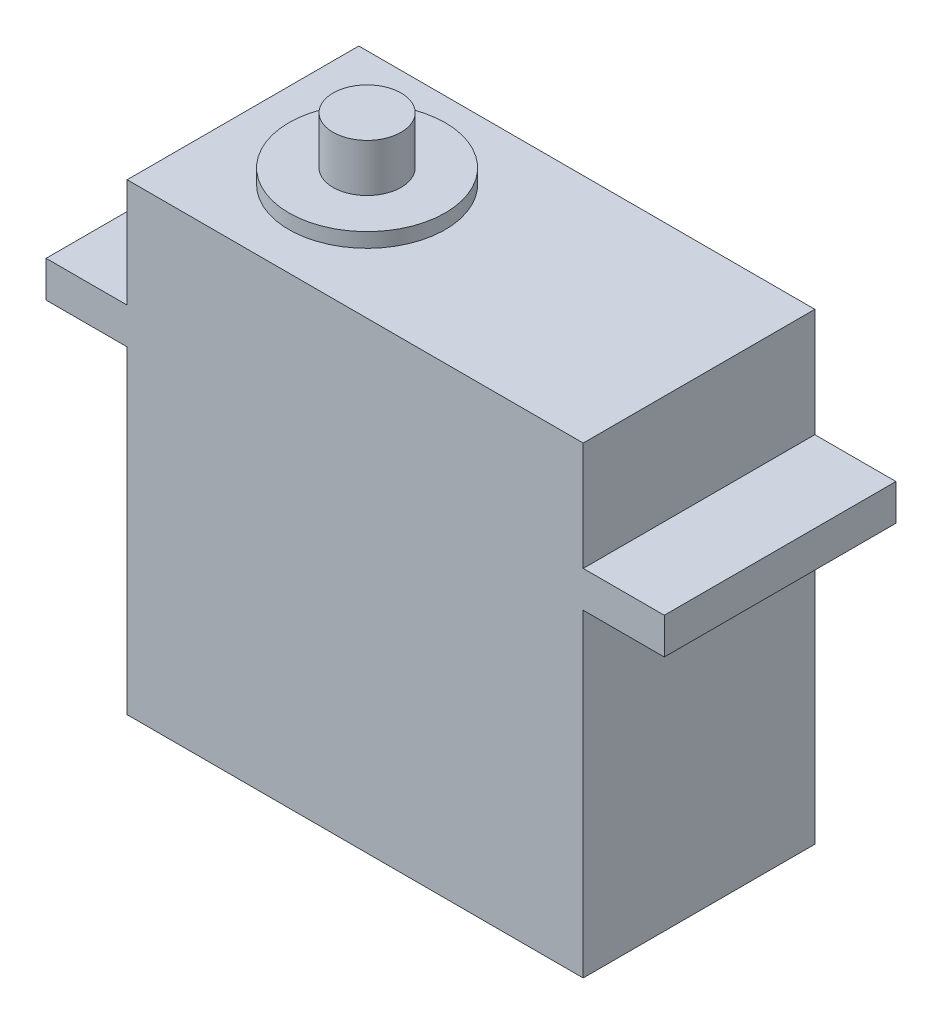
ISO-10303-21;
HEADER;
FILE_DESCRIPTION(('STEP AP214'),'2;1');
FILE_NAME('part.step','',(''),(''),'','','');
FILE_SCHEMA(('AUTOMOTIVE_DESIGN { 1 0 10303 214 1 1 1 1 }'));
ENDSEC;
DATA;
#1=APPLICATION_CONTEXT('core data for automotive mechanical design processes');
#2=APPLICATION_PROTOCOL_DEFINITION('international standard','automotive_design',2000,#1);
#3=PRODUCT_CONTEXT('',#1,'mechanical');
#4=PRODUCT('Part','Part','',(#3));
#5=PRODUCT_RELATED_PRODUCT_CATEGORY('part','',(#4));
#6=PRODUCT_DEFINITION_FORMATION('','',#4);
#7=PRODUCT_DEFINITION_CONTEXT('part definition',#1,'design');
#8=PRODUCT_DEFINITION('design','',#6,#7);
#9=PRODUCT_DEFINITION_SHAPE('','',#8);
#10=(LENGTH_UNIT() NAMED_UNIT(*) SI_UNIT(.MILLI.,.METRE.));
#11=(NAMED_UNIT(*) PLANE_ANGLE_UNIT() SI_UNIT($,.RADIAN.));
#12=(NAMED_UNIT(*) SI_UNIT($,.STERADIAN.) SOLID_ANGLE_UNIT());
#13=UNCERTAINTY_MEASURE_WITH_UNIT(LENGTH_MEASURE(1.E-05),#10,'distance_accuracy_value','');
#14=(GEOMETRIC_REPRESENTATION_CONTEXT(3) GLOBAL_UNCERTAINTY_ASSIGNED_CONTEXT((#13)) GLOBAL_UNIT_ASSIGNED_CONTEXT((#10,
#11,#12)) REPRESENTATION_CONTEXT('',''));
#15=CARTESIAN_POINT('',(0.,0.,0.));
#16=DIRECTION('',(0.,0.,1.));
#17=DIRECTION('',(1.,0.,0.));
#18=AXIS2_PLACEMENT_3D('',#15,#16,#17);
#19=CARTESIAN_POINT('',(0.,0.,20.32));
#20=DIRECTION('',(1.,0.,0.));
#21=DIRECTION('',(0.,0.,-1.));
#22=AXIS2_PLACEMENT_3D('',#19,#20,#21);
#23=PLANE('',#22);
#24=DIRECTION('',(0.,-1.,0.));
#25=VECTOR('',#24,1.);
#26=CARTESIAN_POINT('',(0.,0.,0.));
#27=LINE('',#26,#25);
#28=CARTESIAN_POINT('',(0.,27.94,0.));
#29=VERTEX_POINT('',#28);
#30=CARTESIAN_POINT('',(0.,0.,0.));
#31=VERTEX_POINT('',#30);
#32=EDGE_CURVE('E170',#29,#31,#27,.T.);
#33=ORIENTED_EDGE('',*,*,#32,.T.);
#34=DIRECTION('',(0.,0.,-1.));
#35=VECTOR('',#34,1.);
#36=CARTESIAN_POINT('',(0.,0.,20.32));
#37=LINE('',#36,#35);
#38=CARTESIAN_POINT('',(0.,0.,20.32));
#39=VERTEX_POINT('',#38);
#40=EDGE_CURVE('E239',#39,#31,#37,.T.);
#41=ORIENTED_EDGE('',*,*,#40,.F.);
#42=DIRECTION('',(0.,-1.,0.));
#43=VECTOR('',#42,1.);
#44=CARTESIAN_POINT('',(0.,0.,20.32));
#45=LINE('',#44,#43);
#46=CARTESIAN_POINT('',(0.,27.94,20.32));
#47=VERTEX_POINT('',#46);
#48=EDGE_CURVE('E205',#47,#39,#45,.T.);
#49=ORIENTED_EDGE('',*,*,#48,.F.);
#50=DIRECTION('',(0.,0.,-1.));
#51=VECTOR('',#50,1.);
#52=CARTESIAN_POINT('',(0.,27.94,20.32));
#53=LINE('',#52,#51);
#54=EDGE_CURVE('E166',#47,#29,#53,.T.);
#55=ORIENTED_EDGE('',*,*,#54,.T.);
#56=EDGE_LOOP('',(#33,#41,#49,#55));
#57=FACE_BOUND('',#56,.T.);
#58=ADVANCED_FACE('F43',(#57),#23,.F.);
#59=CARTESIAN_POINT('',(0.,0.,20.32));
#60=DIRECTION('',(0.,1.,0.));
#61=DIRECTION('',(0.,0.,1.));
#62=AXIS2_PLACEMENT_3D('',#59,#60,#61);
#63=PLANE('',#62);
#64=DIRECTION('',(1.,0.,0.));
#65=VECTOR('',#64,1.);
#66=CARTESIAN_POINT('',(0.,0.,0.));
#67=LINE('',#66,#65);
#68=CARTESIAN_POINT('',(40.005,0.,0.));
#69=VERTEX_POINT('',#68);
#70=EDGE_CURVE('E174',#31,#69,#67,.T.);
#71=ORIENTED_EDGE('',*,*,#70,.T.);
#72=DIRECTION('',(0.,0.,-1.));
#73=VECTOR('',#72,1.);
#74=CARTESIAN_POINT('',(40.005,0.,20.32));
#75=LINE('',#74,#73);
#76=CARTESIAN_POINT('',(40.005,0.,20.32));
#77=VERTEX_POINT('',#76);
#78=EDGE_CURVE('E236',#77,#69,#75,.T.);
#79=ORIENTED_EDGE('',*,*,#78,.F.);
#80=DIRECTION('',(1.,0.,0.));
#81=VECTOR('',#80,1.);
#82=CARTESIAN_POINT('',(0.,0.,20.32));
#83=LINE('',#82,#81);
#84=EDGE_CURVE('E117',#39,#77,#83,.T.);
#85=ORIENTED_EDGE('',*,*,#84,.F.);
#86=ORIENTED_EDGE('',*,*,#40,.T.);
#87=EDGE_LOOP('',(#71,#79,#85,#86));
#88=FACE_BOUND('',#87,.T.);
#89=ADVANCED_FACE('F278',(#88),#63,.F.);
#90=CARTESIAN_POINT('',(40.005,0.,20.32));
#91=DIRECTION('',(-1.,0.,0.));
#92=DIRECTION('',(0.,0.,1.));
#93=AXIS2_PLACEMENT_3D('',#90,#91,#92);
#94=PLANE('',#93);
#95=DIRECTION('',(0.,1.,0.));
#96=VECTOR('',#95,1.);
#97=CARTESIAN_POINT('',(40.005,0.,0.));
#98=LINE('',#97,#96);
#99=CARTESIAN_POINT('',(40.005,27.94,0.));
#100=VERTEX_POINT('',#99);
#101=EDGE_CURVE('E178',#69,#100,#98,.T.);
#102=ORIENTED_EDGE('',*,*,#101,.T.);
#103=DIRECTION('',(0.,0.,-1.));
#104=VECTOR('',#103,1.);
#105=CARTESIAN_POINT('',(40.005,27.94,20.32));
#106=LINE('',#105,#104);
#107=CARTESIAN_POINT('',(40.005,27.94,20.32));
#108=VERTEX_POINT('',#107);
#109=EDGE_CURVE('E232',#108,#100,#106,.T.);
#110=ORIENTED_EDGE('',*,*,#109,.F.);
#111=DIRECTION('',(0.,1.,0.));
#112=VECTOR('',#111,1.);
#113=CARTESIAN_POINT('',(40.005,0.,20.32));
#114=LINE('',#113,#112);
#115=EDGE_CURVE('E474',#77,#108,#114,.T.);
#116=ORIENTED_EDGE('',*,*,#115,.F.);
#117=ORIENTED_EDGE('',*,*,#78,.T.);
#118=EDGE_LOOP('',(#102,#110,#116,#117));
#119=FACE_BOUND('',#118,.T.);
#120=ADVANCED_FACE('F282',(#119),#94,.F.);
#121=CARTESIAN_POINT('',(40.005,27.94,20.32));
#122=DIRECTION('',(0.,1.,0.));
#123=DIRECTION('',(-1.,0.,0.));
#124=AXIS2_PLACEMENT_3D('',#121,#122,#123);
#125=PLANE('',#124);
#126=DIRECTION('',(1.,0.,0.));
#127=VECTOR('',#126,1.);
#128=CARTESIAN_POINT('',(40.005,27.94,0.));
#129=LINE('',#128,#127);
#130=CARTESIAN_POINT('',(47.117,27.94,0.));
#131=VERTEX_POINT('',#130);
#132=EDGE_CURVE('E181',#100,#131,#129,.T.);
#133=ORIENTED_EDGE('',*,*,#132,.T.);
#134=DIRECTION('',(0.,0.,-1.));
#135=VECTOR('',#134,1.);
#136=CARTESIAN_POINT('',(47.117,27.94,20.32));
#137=LINE('',#136,#135);
#138=CARTESIAN_POINT('',(47.117,27.94,20.32));
#139=VERTEX_POINT('',#138);
#140=EDGE_CURVE('E228',#139,#131,#137,.T.);
#141=ORIENTED_EDGE('',*,*,#140,.F.);
#142=DIRECTION('',(1.,0.,0.));
#143=VECTOR('',#142,1.);
#144=CARTESIAN_POINT('',(40.005,27.94,20.32));
#145=LINE('',#144,#143);
#146=EDGE_CURVE('E477',#108,#139,#145,.T.);
#147=ORIENTED_EDGE('',*,*,#146,.F.);
#148=ORIENTED_EDGE('',*,*,#109,.T.);
#149=EDGE_LOOP('',(#133,#141,#147,#148));
#150=FACE_BOUND('',#149,.T.);
#151=ADVANCED_FACE('F286',(#150),#125,.F.);
#152=CARTESIAN_POINT('',(47.117,31.115,20.32));
#153=DIRECTION('',(-1.,0.,0.));
#154=DIRECTION('',(0.,-1.,0.));
#155=AXIS2_PLACEMENT_3D('',#152,#153,#154);
#156=PLANE('',#155);
#157=DIRECTION('',(0.,1.,0.));
#158=VECTOR('',#157,1.);
#159=CARTESIAN_POINT('',(47.117,31.115,0.));
#160=LINE('',#159,#158);
#161=CARTESIAN_POINT('',(47.117,31.115,0.));
#162=VERTEX_POINT('',#161);
#163=EDGE_CURVE('E184',#131,#162,#160,.T.);
#164=ORIENTED_EDGE('',*,*,#163,.T.);
#165=DIRECTION('',(0.,0.,-1.));
#166=VECTOR('',#165,1.);
#167=CARTESIAN_POINT('',(47.117,31.115,20.32));
#168=LINE('',#167,#166);
#169=CARTESIAN_POINT('',(47.117,31.115,20.32));
#170=VERTEX_POINT('',#169);
#171=EDGE_CURVE('E224',#170,#162,#168,.T.);
#172=ORIENTED_EDGE('',*,*,#171,.F.);
#173=DIRECTION('',(0.,1.,0.));
#174=VECTOR('',#173,1.);
#175=CARTESIAN_POINT('',(47.117,31.115,20.32));
#176=LINE('',#175,#174);
#177=EDGE_CURVE('E480',#139,#170,#176,.T.);
#178=ORIENTED_EDGE('',*,*,#177,.F.);
#179=ORIENTED_EDGE('',*,*,#140,.T.);
#180=EDGE_LOOP('',(#164,#172,#178,#179));
#181=FACE_BOUND('',#180,.T.);
#182=ADVANCED_FACE('F292',(#181),#156,.F.);
#183=CARTESIAN_POINT('',(40.005,31.115,20.32));
#184=DIRECTION('',(0.,-1.,0.));
#185=DIRECTION('',(0.,0.,-1.));
#186=AXIS2_PLACEMENT_3D('',#183,#184,#185);
#187=PLANE('',#186);
#188=DIRECTION('',(-1.,0.,0.));
#189=VECTOR('',#188,1.);
#190=CARTESIAN_POINT('',(40.005,31.115,0.));
#191=LINE('',#190,#189);
#192=CARTESIAN_POINT('',(40.005,31.115,0.));
#193=VERTEX_POINT('',#192);
#194=EDGE_CURVE('E187',#162,#193,#191,.T.);
#195=ORIENTED_EDGE('',*,*,#194,.T.);
#196=DIRECTION('',(0.,0.,-1.));
#197=VECTOR('',#196,1.);
#198=CARTESIAN_POINT('',(40.005,31.115,20.32));
#199=LINE('',#198,#197);
#200=CARTESIAN_POINT('',(40.005,31.115,20.32));
#201=VERTEX_POINT('',#200);
#202=EDGE_CURVE('E220',#201,#193,#199,.T.);
#203=ORIENTED_EDGE('',*,*,#202,.F.);
#204=DIRECTION('',(-1.,0.,0.));
#205=VECTOR('',#204,1.);
#206=CARTESIAN_POINT('',(40.005,31.115,20.32));
#207=LINE('',#206,#205);
#208=EDGE_CURVE('E483',#170,#201,#207,.T.);
#209=ORIENTED_EDGE('',*,*,#208,.F.);
#210=ORIENTED_EDGE('',*,*,#171,.T.);
#211=EDGE_LOOP('',(#195,#203,#209,#210));
#212=FACE_BOUND('',#211,.T.);
#213=ADVANCED_FACE('F296',(#212),#187,.F.);
#214=CARTESIAN_POINT('',(40.005,31.115,20.32));
#215=DIRECTION('',(-1.,0.,0.));
#216=DIRECTION('',(0.,0.,1.));
#217=AXIS2_PLACEMENT_3D('',#214,#215,#216);
#218=PLANE('',#217);
#219=DIRECTION('',(0.,1.,0.));
#220=VECTOR('',#219,1.);
#221=CARTESIAN_POINT('',(40.005,31.115,0.));
#222=LINE('',#221,#220);
#223=CARTESIAN_POINT('',(40.005,40.64,0.));
#224=VERTEX_POINT('',#223);
#225=EDGE_CURVE('E190',#193,#224,#222,.T.);
#226=ORIENTED_EDGE('',*,*,#225,.T.);
#227=DIRECTION('',(0.,0.,-1.));
#228=VECTOR('',#227,1.);
#229=CARTESIAN_POINT('',(40.005,40.64,20.32));
#230=LINE('',#229,#228);
#231=CARTESIAN_POINT('',(40.005,40.64,20.32));
#232=VERTEX_POINT('',#231);
#233=EDGE_CURVE('E216',#232,#224,#230,.T.);
#234=ORIENTED_EDGE('',*,*,#233,.F.);
#235=DIRECTION('',(0.,1.,0.));
#236=VECTOR('',#235,1.);
#237=CARTESIAN_POINT('',(40.005,31.115,20.32));
#238=LINE('',#237,#236);
#239=EDGE_CURVE('E486',#201,#232,#238,.T.);
#240=ORIENTED_EDGE('',*,*,#239,.F.);
#241=ORIENTED_EDGE('',*,*,#202,.T.);
#242=EDGE_LOOP('',(#226,#234,#240,#241));
#243=FACE_BOUND('',#242,.T.);
#244=ADVANCED_FACE('F252',(#243),#218,.F.);
#245=CARTESIAN_POINT('',(0.,40.64,20.32));
#246=DIRECTION('',(0.,-1.,0.));
#247=DIRECTION('',(0.,0.,-1.));
#248=AXIS2_PLACEMENT_3D('',#245,#246,#247);
#249=PLANE('',#248);
#250=CARTESIAN_POINT('',(10.8863335840324,40.64,10.16));
#251=DIRECTION('',(0.,-1.,0.));
#252=DIRECTION('',(0.,0.,-1.));
#253=AXIS2_PLACEMENT_3D('',#250,#251,#252);
#254=CIRCLE('',#253,6.858);
#255=CARTESIAN_POINT('',(10.8863335840324,40.64,3.302));
#256=VERTEX_POINT('',#255);
#257=EDGE_CURVE('E46',#256,#256,#254,.F.);
#258=ORIENTED_EDGE('',*,*,#257,.F.);
#259=EDGE_LOOP('',(#258));
#260=FACE_BOUND('',#259,.T.);
#261=DIRECTION('',(-1.,0.,0.));
#262=VECTOR('',#261,1.);
#263=CARTESIAN_POINT('',(0.,40.64,0.));
#264=LINE('',#263,#262);
#265=CARTESIAN_POINT('',(0.,40.64,0.));
#266=VERTEX_POINT('',#265);
#267=EDGE_CURVE('E193',#224,#266,#264,.T.);
#268=ORIENTED_EDGE('',*,*,#267,.T.);
#269=DIRECTION('',(0.,0.,-1.));
#270=VECTOR('',#269,1.);
#271=CARTESIAN_POINT('',(0.,40.64,20.32));
#272=LINE('',#271,#270);
#273=CARTESIAN_POINT('',(0.,40.64,20.32));
#274=VERTEX_POINT('',#273);
#275=EDGE_CURVE('E212',#274,#266,#272,.T.);
#276=ORIENTED_EDGE('',*,*,#275,.F.);
#277=DIRECTION('',(-1.,0.,0.));
#278=VECTOR('',#277,1.);
#279=CARTESIAN_POINT('',(0.,40.64,20.32));
#280=LINE('',#279,#278);
#281=EDGE_CURVE('E489',#232,#274,#280,.T.);
#282=ORIENTED_EDGE('',*,*,#281,.F.);
#283=ORIENTED_EDGE('',*,*,#233,.T.);
#284=EDGE_LOOP('',(#268,#276,#282,#283));
#285=FACE_BOUND('',#284,.T.);
#286=ADVANCED_FACE('F248',(#260,#285),#249,.F.);
#287=CARTESIAN_POINT('',(0.,31.115,20.32));
#288=DIRECTION('',(1.,0.,0.));
#289=DIRECTION('',(0.,0.,-1.));
#290=AXIS2_PLACEMENT_3D('',#287,#288,#289);
#291=PLANE('',#290);
#292=DIRECTION('',(0.,-1.,0.));
#293=VECTOR('',#292,1.);
#294=CARTESIAN_POINT('',(0.,31.115,0.));
#295=LINE('',#294,#293);
#296=CARTESIAN_POINT('',(0.,31.115,0.));
#297=VERTEX_POINT('',#296);
#298=EDGE_CURVE('E196',#266,#297,#295,.T.);
#299=ORIENTED_EDGE('',*,*,#298,.T.);
#300=DIRECTION('',(0.,0.,-1.));
#301=VECTOR('',#300,1.);
#302=CARTESIAN_POINT('',(0.,31.115,20.32));
#303=LINE('',#302,#301);
#304=CARTESIAN_POINT('',(0.,31.115,20.32));
#305=VERTEX_POINT('',#304);
#306=EDGE_CURVE('E159',#305,#297,#303,.T.);
#307=ORIENTED_EDGE('',*,*,#306,.F.);
#308=DIRECTION('',(0.,-1.,0.));
#309=VECTOR('',#308,1.);
#310=CARTESIAN_POINT('',(0.,31.115,20.32));
#311=LINE('',#310,#309);
#312=EDGE_CURVE('E148',#274,#305,#311,.T.);
#313=ORIENTED_EDGE('',*,*,#312,.F.);
#314=ORIENTED_EDGE('',*,*,#275,.T.);
#315=EDGE_LOOP('',(#299,#307,#313,#314));
#316=FACE_BOUND('',#315,.T.);
#317=ADVANCED_FACE('F251',(#316),#291,.F.);
#318=CARTESIAN_POINT('',(0.,31.115,20.32));
#319=DIRECTION('',(0.,-1.,0.));
#320=DIRECTION('',(0.,0.,-1.));
#321=AXIS2_PLACEMENT_3D('',#318,#319,#320);
#322=PLANE('',#321);
#323=DIRECTION('',(-1.,0.,0.));
#324=VECTOR('',#323,1.);
#325=CARTESIAN_POINT('',(0.,31.115,0.));
#326=LINE('',#325,#324);
#327=CARTESIAN_POINT('',(-7.11199999999999,31.115,0.));
#328=VERTEX_POINT('',#327);
#329=EDGE_CURVE('E157',#297,#328,#326,.T.);
#330=ORIENTED_EDGE('',*,*,#329,.T.);
#331=DIRECTION('',(0.,0.,-1.));
#332=VECTOR('',#331,1.);
#333=CARTESIAN_POINT('',(-7.11199999999999,31.115,20.32));
#334=LINE('',#333,#332);
#335=CARTESIAN_POINT('',(-7.11199999999999,31.115,20.32));
#336=VERTEX_POINT('',#335);
#337=EDGE_CURVE('E154',#336,#328,#334,.T.);
#338=ORIENTED_EDGE('',*,*,#337,.F.);
#339=DIRECTION('',(-1.,0.,0.));
#340=VECTOR('',#339,1.);
#341=CARTESIAN_POINT('',(0.,31.115,20.32));
#342=LINE('',#341,#340);
#343=EDGE_CURVE('E142',#305,#336,#342,.T.);
#344=ORIENTED_EDGE('',*,*,#343,.F.);
#345=ORIENTED_EDGE('',*,*,#306,.T.);
#346=EDGE_LOOP('',(#330,#338,#344,#345));
#347=FACE_BOUND('',#346,.T.);
#348=ADVANCED_FACE('F155',(#347),#322,.F.);
#349=CARTESIAN_POINT('',(-7.11199999999999,31.115,20.32));
#350=DIRECTION('',(1.,0.,0.));
#351=DIRECTION('',(0.,1.,0.));
#352=AXIS2_PLACEMENT_3D('',#349,#350,#351);
#353=PLANE('',#352);
#354=DIRECTION('',(0.,-1.,0.));
#355=VECTOR('',#354,1.);
#356=CARTESIAN_POINT('',(-7.11199999999999,31.115,0.));
#357=LINE('',#356,#355);
#358=CARTESIAN_POINT('',(-7.112,27.94,0.));
#359=VERTEX_POINT('',#358);
#360=EDGE_CURVE('E102',#328,#359,#357,.T.);
#361=ORIENTED_EDGE('',*,*,#360,.T.);
#362=DIRECTION('',(0.,0.,-1.));
#363=VECTOR('',#362,1.);
#364=CARTESIAN_POINT('',(-7.112,27.94,20.32));
#365=LINE('',#364,#363);
#366=CARTESIAN_POINT('',(-7.112,27.94,20.32));
#367=VERTEX_POINT('',#366);
#368=EDGE_CURVE('E160',#367,#359,#365,.T.);
#369=ORIENTED_EDGE('',*,*,#368,.F.);
#370=DIRECTION('',(0.,-1.,0.));
#371=VECTOR('',#370,1.);
#372=CARTESIAN_POINT('',(-7.11199999999999,31.115,20.32));
#373=LINE('',#372,#371);
#374=EDGE_CURVE('E146',#336,#367,#373,.T.);
#375=ORIENTED_EDGE('',*,*,#374,.F.);
#376=ORIENTED_EDGE('',*,*,#337,.T.);
#377=EDGE_LOOP('',(#361,#369,#375,#376));
#378=FACE_BOUND('',#377,.T.);
#379=ADVANCED_FACE('F162',(#378),#353,.F.);
#380=CARTESIAN_POINT('',(0.,27.94,20.32));
#381=DIRECTION('',(0.,1.,0.));
#382=DIRECTION('',(-1.,0.,0.));
#383=AXIS2_PLACEMENT_3D('',#380,#381,#382);
#384=PLANE('',#383);
#385=DIRECTION('',(1.,0.,0.));
#386=VECTOR('',#385,1.);
#387=CARTESIAN_POINT('',(0.,27.94,0.));
#388=LINE('',#387,#386);
#389=EDGE_CURVE('E108',#359,#29,#388,.T.);
#390=ORIENTED_EDGE('',*,*,#389,.T.);
#391=ORIENTED_EDGE('',*,*,#54,.F.);
#392=DIRECTION('',(1.,0.,0.));
#393=VECTOR('',#392,1.);
#394=CARTESIAN_POINT('',(0.,27.94,20.32));
#395=LINE('',#394,#393);
#396=EDGE_CURVE('E61',#367,#47,#395,.T.);
#397=ORIENTED_EDGE('',*,*,#396,.F.);
#398=ORIENTED_EDGE('',*,*,#368,.T.);
#399=EDGE_LOOP('',(#390,#391,#397,#398));
#400=FACE_BOUND('',#399,.T.);
#401=ADVANCED_FACE('F267',(#400),#384,.F.);
#402=CARTESIAN_POINT('',(0.,0.,20.32));
#403=DIRECTION('',(0.,0.,1.));
#404=DIRECTION('',(1.,0.,0.));
#405=AXIS2_PLACEMENT_3D('',#402,#403,#404);
#406=PLANE('',#405);
#407=ORIENTED_EDGE('',*,*,#48,.T.);
#408=ORIENTED_EDGE('',*,*,#84,.T.);
#409=ORIENTED_EDGE('',*,*,#115,.T.);
#410=ORIENTED_EDGE('',*,*,#146,.T.);
#411=ORIENTED_EDGE('',*,*,#177,.T.);
#412=ORIENTED_EDGE('',*,*,#208,.T.);
#413=ORIENTED_EDGE('',*,*,#239,.T.);
#414=ORIENTED_EDGE('',*,*,#281,.T.);
#415=ORIENTED_EDGE('',*,*,#312,.T.);
#416=ORIENTED_EDGE('',*,*,#343,.T.);
#417=ORIENTED_EDGE('',*,*,#374,.T.);
#418=ORIENTED_EDGE('',*,*,#396,.T.);
#419=EDGE_LOOP('',(#407,#408,#409,#410,#411,#412,#413,#414,#415,#416,#417,#418));
#420=FACE_BOUND('',#419,.T.);
#421=ADVANCED_FACE('F144',(#420),#406,.T.);
#422=CARTESIAN_POINT('',(0.,0.,0.));
#423=DIRECTION('',(0.,0.,1.));
#424=DIRECTION('',(1.,0.,0.));
#425=AXIS2_PLACEMENT_3D('',#422,#423,#424);
#426=PLANE('',#425);
#427=ORIENTED_EDGE('',*,*,#32,.F.);
#428=ORIENTED_EDGE('',*,*,#389,.F.);
#429=ORIENTED_EDGE('',*,*,#360,.F.);
#430=ORIENTED_EDGE('',*,*,#329,.F.);
#431=ORIENTED_EDGE('',*,*,#298,.F.);
#432=ORIENTED_EDGE('',*,*,#267,.F.);
#433=ORIENTED_EDGE('',*,*,#225,.F.);
#434=ORIENTED_EDGE('',*,*,#194,.F.);
#435=ORIENTED_EDGE('',*,*,#163,.F.);
#436=ORIENTED_EDGE('',*,*,#132,.F.);
#437=ORIENTED_EDGE('',*,*,#101,.F.);
#438=ORIENTED_EDGE('',*,*,#70,.F.);
#439=EDGE_LOOP('',(#427,#428,#429,#430,#431,#432,#433,#434,#435,#436,#437,#438));
#440=FACE_BOUND('',#439,.T.);
#441=ADVANCED_FACE('F263',(#440),#426,.F.);
#442=CARTESIAN_POINT('',(10.8863335840324,41.91,10.16));
#443=DIRECTION('',(0.,-1.,0.));
#444=DIRECTION('',(0.,0.,-1.));
#445=AXIS2_PLACEMENT_3D('',#442,#443,#444);
#446=CYLINDRICAL_SURFACE('',#445,6.858);
#447=CARTESIAN_POINT('',(10.8863335840324,41.91,10.16));
#448=DIRECTION('',(0.,1.,0.));
#449=DIRECTION('',(0.,0.,1.));
#450=AXIS2_PLACEMENT_3D('',#447,#448,#449);
#451=CIRCLE('',#450,6.858);
#452=CARTESIAN_POINT('',(10.8863335840324,41.91,17.018));
#453=VERTEX_POINT('',#452);
#454=EDGE_CURVE('E175',#453,#453,#451,.T.);
#455=ORIENTED_EDGE('',*,*,#454,.F.);
#456=EDGE_LOOP('',(#455));
#457=FACE_BOUND('',#456,.T.);
#458=ORIENTED_EDGE('',*,*,#257,.T.);
#459=EDGE_LOOP('',(#458));
#460=FACE_BOUND('',#459,.T.);
#461=ADVANCED_FACE('F246',(#457,#460),#446,.T.);
#462=CARTESIAN_POINT('',(10.8863335840324,41.91,10.16));
#463=DIRECTION('',(0.,1.,0.));
#464=DIRECTION('',(0.,0.,1.));
#465=AXIS2_PLACEMENT_3D('',#462,#463,#464);
#466=PLANE('',#465);
#467=CARTESIAN_POINT('',(10.8863335840324,41.91,10.16));
#468=DIRECTION('',(0.,1.,0.));
#469=DIRECTION('',(0.,0.,1.));
#470=AXIS2_PLACEMENT_3D('',#467,#468,#469);
#471=CIRCLE('',#470,2.9845);
#472=CARTESIAN_POINT('',(10.8863335840324,41.91,13.1445));
#473=VERTEX_POINT('',#472);
#474=EDGE_CURVE('E11',#473,#473,#471,.T.);
#475=ORIENTED_EDGE('',*,*,#474,.F.);
#476=EDGE_LOOP('',(#475));
#477=FACE_BOUND('',#476,.T.);
#478=ORIENTED_EDGE('',*,*,#454,.T.);
#479=EDGE_LOOP('',(#478));
#480=FACE_BOUND('',#479,.T.);
#481=ADVANCED_FACE('F354',(#477,#480),#466,.T.);
#482=CARTESIAN_POINT('',(10.8863335840324,46.101,10.16));
#483=DIRECTION('',(0.,-1.,0.));
#484=DIRECTION('',(0.,0.,-1.));
#485=AXIS2_PLACEMENT_3D('',#482,#483,#484);
#486=CYLINDRICAL_SURFACE('',#485,2.9845);
#487=CARTESIAN_POINT('',(10.8863335840324,46.101,10.16));
#488=DIRECTION('',(0.,1.,0.));
#489=DIRECTION('',(0.,0.,1.));
#490=AXIS2_PLACEMENT_3D('',#487,#488,#489);
#491=CIRCLE('',#490,2.9845);
#492=CARTESIAN_POINT('',(10.8863335840324,46.101,13.1445));
#493=VERTEX_POINT('',#492);
#494=EDGE_CURVE('E463',#493,#493,#491,.T.);
#495=ORIENTED_EDGE('',*,*,#494,.F.);
#496=EDGE_LOOP('',(#495));
#497=FACE_BOUND('',#496,.T.);
#498=ORIENTED_EDGE('',*,*,#474,.T.);
#499=EDGE_LOOP('',(#498));
#500=FACE_BOUND('',#499,.T.);
#501=ADVANCED_FACE('F365',(#497,#500),#486,.T.);
#502=CARTESIAN_POINT('',(10.8863335840324,46.101,10.16));
#503=DIRECTION('',(0.,1.,0.));
#504=DIRECTION('',(0.,0.,1.));
#505=AXIS2_PLACEMENT_3D('',#502,#503,#504);
#506=PLANE('',#505);
#507=ORIENTED_EDGE('',*,*,#494,.T.);
#508=EDGE_LOOP('',(#507));
#509=FACE_BOUND('',#508,.T.);
#510=ADVANCED_FACE('F376',(#509),#506,.T.);
#511=CLOSED_SHELL('',(#58,#89,#120,#151,#182,#213,#244,#286,#317,#348,#379,#401,#421,#441,#461,
#481,#501,#510));
#512=MANIFOLD_SOLID_BREP('B2',#511);
#513=ADVANCED_BREP_SHAPE_REPRESENTATION('',(#18,#512),#14);
#514=SHAPE_DEFINITION_REPRESENTATION(#9,#513);
ENDSEC;
END-ISO-10303-21;
